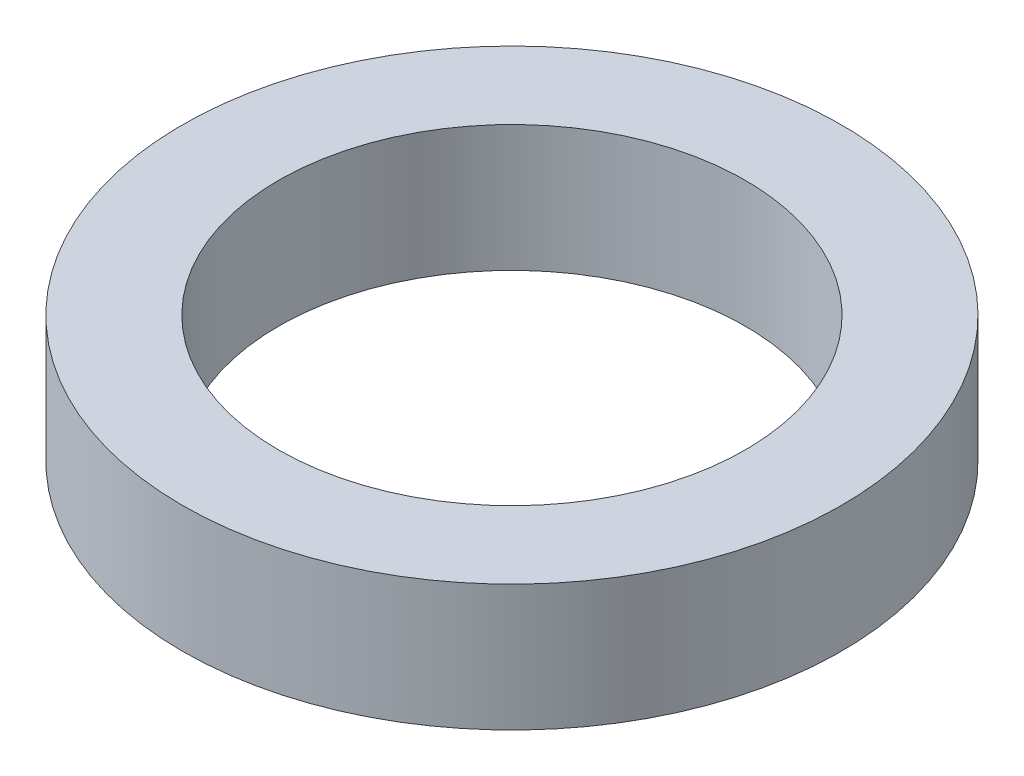
ISO-10303-21;
HEADER;
FILE_DESCRIPTION(('STEP AP214'),'2;1');
FILE_NAME('part.step','',(''),(''),'','','');
FILE_SCHEMA(('AUTOMOTIVE_DESIGN { 1 0 10303 214 1 1 1 1 }'));
ENDSEC;
DATA;
#1=APPLICATION_CONTEXT('core data for automotive mechanical design processes');
#2=APPLICATION_PROTOCOL_DEFINITION('international standard','automotive_design',2000,#1);
#3=PRODUCT_CONTEXT('',#1,'mechanical');
#4=PRODUCT('Part','Part','',(#3));
#5=PRODUCT_RELATED_PRODUCT_CATEGORY('part','',(#4));
#6=PRODUCT_DEFINITION_FORMATION('','',#4);
#7=PRODUCT_DEFINITION_CONTEXT('part definition',#1,'design');
#8=PRODUCT_DEFINITION('design','',#6,#7);
#9=PRODUCT_DEFINITION_SHAPE('','',#8);
#10=(LENGTH_UNIT() NAMED_UNIT(*) SI_UNIT(.MILLI.,.METRE.));
#11=(NAMED_UNIT(*) PLANE_ANGLE_UNIT() SI_UNIT($,.RADIAN.));
#12=(NAMED_UNIT(*) SI_UNIT($,.STERADIAN.) SOLID_ANGLE_UNIT());
#13=UNCERTAINTY_MEASURE_WITH_UNIT(LENGTH_MEASURE(1.E-05),#10,'distance_accuracy_value','');
#14=(GEOMETRIC_REPRESENTATION_CONTEXT(3) GLOBAL_UNCERTAINTY_ASSIGNED_CONTEXT((#13)) GLOBAL_UNIT_ASSIGNED_CONTEXT((#10,
#11,#12)) REPRESENTATION_CONTEXT('',''));
#15=CARTESIAN_POINT('',(0.,0.,0.));
#16=DIRECTION('',(0.,0.,1.));
#17=DIRECTION('',(1.,0.,0.));
#18=AXIS2_PLACEMENT_3D('',#15,#16,#17);
#19=CARTESIAN_POINT('',(0.,23.,0.));
#20=DIRECTION('',(0.,-1.,0.));
#21=DIRECTION('',(0.,0.,-1.));
#22=AXIS2_PLACEMENT_3D('',#19,#20,#21);
#23=CYLINDRICAL_SURFACE('',#22,60.);
#24=CARTESIAN_POINT('',(0.,23.,0.));
#25=DIRECTION('',(0.,1.,0.));
#26=DIRECTION('',(0.,0.,1.));
#27=AXIS2_PLACEMENT_3D('',#24,#25,#26);
#28=CIRCLE('',#27,60.);
#29=CARTESIAN_POINT('',(0.,23.,60.));
#30=VERTEX_POINT('',#29);
#31=EDGE_CURVE('E10',#30,#30,#28,.T.);
#32=ORIENTED_EDGE('',*,*,#31,.F.);
#33=EDGE_LOOP('',(#32));
#34=FACE_BOUND('',#33,.T.);
#35=CARTESIAN_POINT('',(0.,0.,0.));
#36=DIRECTION('',(0.,1.,0.));
#37=DIRECTION('',(0.,0.,1.));
#38=AXIS2_PLACEMENT_3D('',#35,#36,#37);
#39=CIRCLE('',#38,60.);
#40=CARTESIAN_POINT('',(0.,0.,60.));
#41=VERTEX_POINT('',#40);
#42=EDGE_CURVE('E37',#41,#41,#39,.T.);
#43=ORIENTED_EDGE('',*,*,#42,.T.);
#44=EDGE_LOOP('',(#43));
#45=FACE_BOUND('',#44,.T.);
#46=ADVANCED_FACE('F40',(#34,#45),#23,.T.);
#47=CARTESIAN_POINT('',(0.,23.,0.));
#48=DIRECTION('',(0.,1.,0.));
#49=DIRECTION('',(0.,0.,1.));
#50=AXIS2_PLACEMENT_3D('',#47,#48,#49);
#51=PLANE('',#50);
#52=CARTESIAN_POINT('',(0.,23.,0.));
#53=DIRECTION('',(0.,1.,0.));
#54=DIRECTION('',(0.,0.,1.));
#55=AXIS2_PLACEMENT_3D('',#52,#53,#54);
#56=CIRCLE('',#55,42.5);
#57=CARTESIAN_POINT('',(0.,23.,42.5));
#58=VERTEX_POINT('',#57);
#59=EDGE_CURVE('E50',#58,#58,#56,.T.);
#60=ORIENTED_EDGE('',*,*,#59,.F.);
#61=EDGE_LOOP('',(#60));
#62=FACE_BOUND('',#61,.T.);
#63=ORIENTED_EDGE('',*,*,#31,.T.);
#64=EDGE_LOOP('',(#63));
#65=FACE_BOUND('',#64,.T.);
#66=ADVANCED_FACE('F59',(#62,#65),#51,.T.);
#67=CARTESIAN_POINT('',(0.,0.,0.));
#68=DIRECTION('',(0.,1.,0.));
#69=DIRECTION('',(0.,0.,1.));
#70=AXIS2_PLACEMENT_3D('',#67,#68,#69);
#71=PLANE('',#70);
#72=CARTESIAN_POINT('',(0.,0.,0.));
#73=DIRECTION('',(0.,1.,0.));
#74=DIRECTION('',(0.,0.,1.));
#75=AXIS2_PLACEMENT_3D('',#72,#73,#74);
#76=CIRCLE('',#75,42.5);
#77=CARTESIAN_POINT('',(0.,0.,42.5));
#78=VERTEX_POINT('',#77);
#79=EDGE_CURVE('E47',#78,#78,#76,.T.);
#80=ORIENTED_EDGE('',*,*,#79,.T.);
#81=EDGE_LOOP('',(#80));
#82=FACE_BOUND('',#81,.T.);
#83=ORIENTED_EDGE('',*,*,#42,.F.);
#84=EDGE_LOOP('',(#83));
#85=FACE_BOUND('',#84,.T.);
#86=ADVANCED_FACE('F58',(#82,#85),#71,.F.);
#87=CARTESIAN_POINT('',(0.,23.,0.));
#88=DIRECTION('',(0.,-1.,0.));
#89=DIRECTION('',(0.,0.,-1.));
#90=AXIS2_PLACEMENT_3D('',#87,#88,#89);
#91=CYLINDRICAL_SURFACE('',#90,42.5);
#92=ORIENTED_EDGE('',*,*,#59,.T.);
#93=EDGE_LOOP('',(#92));
#94=FACE_BOUND('',#93,.T.);
#95=ORIENTED_EDGE('',*,*,#79,.F.);
#96=EDGE_LOOP('',(#95));
#97=FACE_BOUND('',#96,.T.);
#98=ADVANCED_FACE('F54',(#94,#97),#91,.F.);
#99=CLOSED_SHELL('',(#46,#66,#86,#98));
#100=MANIFOLD_SOLID_BREP('B2',#99);
#101=ADVANCED_BREP_SHAPE_REPRESENTATION('',(#18,#100),#14);
#102=SHAPE_DEFINITION_REPRESENTATION(#9,#101);
ENDSEC;
END-ISO-10303-21;
